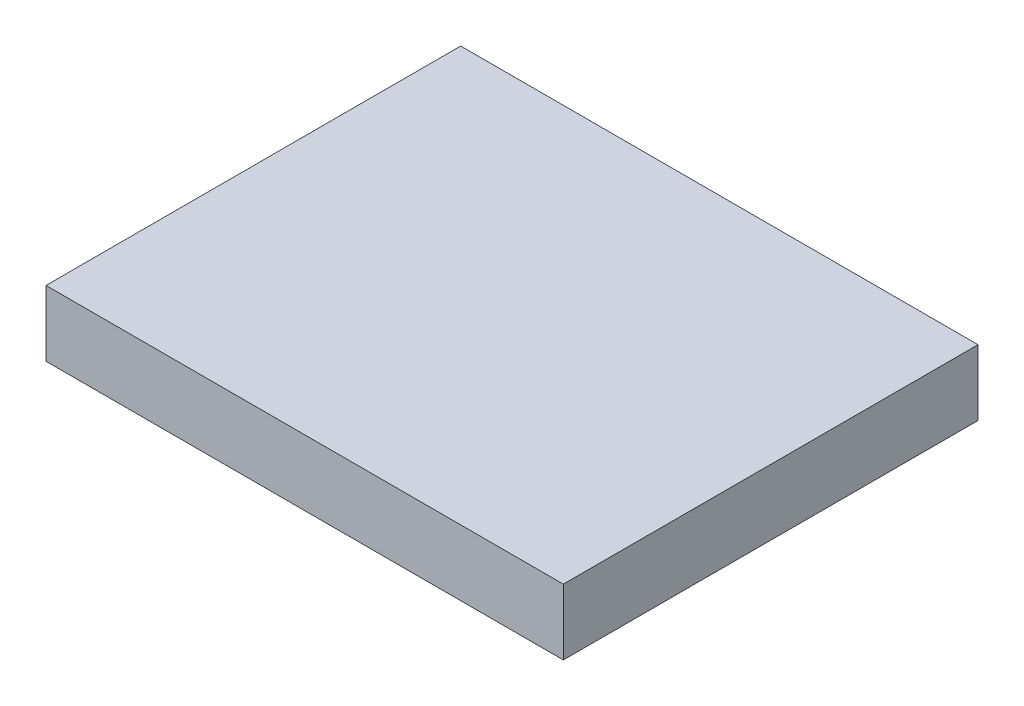
ISO-10303-21;
HEADER;
FILE_DESCRIPTION(('STEP AP214'),'2;1');
FILE_NAME('part.step','',(''),(''),'','','');
FILE_SCHEMA(('AUTOMOTIVE_DESIGN { 1 0 10303 214 1 1 1 1 }'));
ENDSEC;
DATA;
#1=APPLICATION_CONTEXT('core data for automotive mechanical design processes');
#2=APPLICATION_PROTOCOL_DEFINITION('international standard','automotive_design',2000,#1);
#3=PRODUCT_CONTEXT('',#1,'mechanical');
#4=PRODUCT('Part','Part','',(#3));
#5=PRODUCT_RELATED_PRODUCT_CATEGORY('part','',(#4));
#6=PRODUCT_DEFINITION_FORMATION('','',#4);
#7=PRODUCT_DEFINITION_CONTEXT('part definition',#1,'design');
#8=PRODUCT_DEFINITION('design','',#6,#7);
#9=PRODUCT_DEFINITION_SHAPE('','',#8);
#10=(LENGTH_UNIT() NAMED_UNIT(*) SI_UNIT(.MILLI.,.METRE.));
#11=(NAMED_UNIT(*) PLANE_ANGLE_UNIT() SI_UNIT($,.RADIAN.));
#12=(NAMED_UNIT(*) SI_UNIT($,.STERADIAN.) SOLID_ANGLE_UNIT());
#13=UNCERTAINTY_MEASURE_WITH_UNIT(LENGTH_MEASURE(1.E-05),#10,'distance_accuracy_value','');
#14=(GEOMETRIC_REPRESENTATION_CONTEXT(3) GLOBAL_UNCERTAINTY_ASSIGNED_CONTEXT((#13)) GLOBAL_UNIT_ASSIGNED_CONTEXT((#10,
#11,#12)) REPRESENTATION_CONTEXT('',''));
#15=CARTESIAN_POINT('',(0.,0.,0.));
#16=DIRECTION('',(0.,0.,1.));
#17=DIRECTION('',(1.,0.,0.));
#18=AXIS2_PLACEMENT_3D('',#15,#16,#17);
#19=CARTESIAN_POINT('',(31.5,8.,25.25));
#20=DIRECTION('',(-1.,0.,0.));
#21=DIRECTION('',(0.,0.,1.));
#22=AXIS2_PLACEMENT_3D('',#19,#20,#21);
#23=PLANE('',#22);
#24=DIRECTION('',(0.,0.,-1.));
#25=VECTOR('',#24,1.);
#26=CARTESIAN_POINT('',(31.5,0.,25.25));
#27=LINE('',#26,#25);
#28=CARTESIAN_POINT('',(31.5,0.,25.25));
#29=VERTEX_POINT('',#28);
#30=CARTESIAN_POINT('',(31.5,0.,-25.25));
#31=VERTEX_POINT('',#30);
#32=EDGE_CURVE('E100',#29,#31,#27,.T.);
#33=ORIENTED_EDGE('',*,*,#32,.T.);
#34=DIRECTION('',(0.,-1.,0.));
#35=VECTOR('',#34,1.);
#36=CARTESIAN_POINT('',(31.5,8.,-25.25));
#37=LINE('',#36,#35);
#38=CARTESIAN_POINT('',(31.5,8.,-25.25));
#39=VERTEX_POINT('',#38);
#40=EDGE_CURVE('E11',#39,#31,#37,.T.);
#41=ORIENTED_EDGE('',*,*,#40,.F.);
#42=DIRECTION('',(0.,0.,-1.));
#43=VECTOR('',#42,1.);
#44=CARTESIAN_POINT('',(31.5,8.,25.25));
#45=LINE('',#44,#43);
#46=CARTESIAN_POINT('',(31.5,8.,25.25));
#47=VERTEX_POINT('',#46);
#48=EDGE_CURVE('E88',#47,#39,#45,.T.);
#49=ORIENTED_EDGE('',*,*,#48,.F.);
#50=DIRECTION('',(0.,-1.,0.));
#51=VECTOR('',#50,1.);
#52=CARTESIAN_POINT('',(31.5,8.,25.25));
#53=LINE('',#52,#51);
#54=EDGE_CURVE('E96',#47,#29,#53,.T.);
#55=ORIENTED_EDGE('',*,*,#54,.T.);
#56=EDGE_LOOP('',(#33,#41,#49,#55));
#57=FACE_BOUND('',#56,.T.);
#58=ADVANCED_FACE('F37',(#57),#23,.F.);
#59=CARTESIAN_POINT('',(-31.5,8.,-25.25));
#60=DIRECTION('',(0.,0.,1.));
#61=DIRECTION('',(1.,0.,0.));
#62=AXIS2_PLACEMENT_3D('',#59,#60,#61);
#63=PLANE('',#62);
#64=DIRECTION('',(-1.,0.,0.));
#65=VECTOR('',#64,1.);
#66=CARTESIAN_POINT('',(-31.5,0.,-25.25));
#67=LINE('',#66,#65);
#68=CARTESIAN_POINT('',(-31.5,0.,-25.25));
#69=VERTEX_POINT('',#68);
#70=EDGE_CURVE('E92',#31,#69,#67,.T.);
#71=ORIENTED_EDGE('',*,*,#70,.T.);
#72=DIRECTION('',(0.,-1.,0.));
#73=VECTOR('',#72,1.);
#74=CARTESIAN_POINT('',(-31.5,8.,-25.25));
#75=LINE('',#74,#73);
#76=CARTESIAN_POINT('',(-31.5,8.,-25.25));
#77=VERTEX_POINT('',#76);
#78=EDGE_CURVE('E45',#77,#69,#75,.T.);
#79=ORIENTED_EDGE('',*,*,#78,.F.);
#80=DIRECTION('',(-1.,0.,0.));
#81=VECTOR('',#80,1.);
#82=CARTESIAN_POINT('',(-31.5,8.,-25.25));
#83=LINE('',#82,#81);
#84=EDGE_CURVE('E83',#39,#77,#83,.T.);
#85=ORIENTED_EDGE('',*,*,#84,.F.);
#86=ORIENTED_EDGE('',*,*,#40,.T.);
#87=EDGE_LOOP('',(#71,#79,#85,#86));
#88=FACE_BOUND('',#87,.T.);
#89=ADVANCED_FACE('F91',(#88),#63,.F.);
#90=CARTESIAN_POINT('',(-31.5,8.,25.25));
#91=DIRECTION('',(1.,0.,0.));
#92=DIRECTION('',(0.,0.,-1.));
#93=AXIS2_PLACEMENT_3D('',#90,#91,#92);
#94=PLANE('',#93);
#95=DIRECTION('',(0.,0.,1.));
#96=VECTOR('',#95,1.);
#97=CARTESIAN_POINT('',(-31.5,0.,25.25));
#98=LINE('',#97,#96);
#99=CARTESIAN_POINT('',(-31.5,0.,25.25));
#100=VERTEX_POINT('',#99);
#101=EDGE_CURVE('E70',#69,#100,#98,.T.);
#102=ORIENTED_EDGE('',*,*,#101,.T.);
#103=DIRECTION('',(0.,-1.,0.));
#104=VECTOR('',#103,1.);
#105=CARTESIAN_POINT('',(-31.5,8.,25.25));
#106=LINE('',#105,#104);
#107=CARTESIAN_POINT('',(-31.5,8.,25.25));
#108=VERTEX_POINT('',#107);
#109=EDGE_CURVE('E93',#108,#100,#106,.T.);
#110=ORIENTED_EDGE('',*,*,#109,.F.);
#111=DIRECTION('',(0.,0.,1.));
#112=VECTOR('',#111,1.);
#113=CARTESIAN_POINT('',(-31.5,8.,25.25));
#114=LINE('',#113,#112);
#115=EDGE_CURVE('E86',#77,#108,#114,.T.);
#116=ORIENTED_EDGE('',*,*,#115,.F.);
#117=ORIENTED_EDGE('',*,*,#78,.T.);
#118=EDGE_LOOP('',(#102,#110,#116,#117));
#119=FACE_BOUND('',#118,.T.);
#120=ADVANCED_FACE('F94',(#119),#94,.F.);
#121=CARTESIAN_POINT('',(-31.5,8.,25.25));
#122=DIRECTION('',(0.,0.,-1.));
#123=DIRECTION('',(-1.,0.,0.));
#124=AXIS2_PLACEMENT_3D('',#121,#122,#123);
#125=PLANE('',#124);
#126=DIRECTION('',(1.,0.,0.));
#127=VECTOR('',#126,1.);
#128=CARTESIAN_POINT('',(-31.5,0.,25.25));
#129=LINE('',#128,#127);
#130=EDGE_CURVE('E76',#100,#29,#129,.T.);
#131=ORIENTED_EDGE('',*,*,#130,.T.);
#132=ORIENTED_EDGE('',*,*,#54,.F.);
#133=DIRECTION('',(1.,0.,0.));
#134=VECTOR('',#133,1.);
#135=CARTESIAN_POINT('',(-31.5,8.,25.25));
#136=LINE('',#135,#134);
#137=EDGE_CURVE('E53',#108,#47,#136,.T.);
#138=ORIENTED_EDGE('',*,*,#137,.F.);
#139=ORIENTED_EDGE('',*,*,#109,.T.);
#140=EDGE_LOOP('',(#131,#132,#138,#139));
#141=FACE_BOUND('',#140,.T.);
#142=ADVANCED_FACE('F107',(#141),#125,.F.);
#143=CARTESIAN_POINT('',(0.,8.,0.));
#144=DIRECTION('',(0.,-1.,0.));
#145=DIRECTION('',(0.,0.,-1.));
#146=AXIS2_PLACEMENT_3D('',#143,#144,#145);
#147=PLANE('',#146);
#148=ORIENTED_EDGE('',*,*,#48,.T.);
#149=ORIENTED_EDGE('',*,*,#84,.T.);
#150=ORIENTED_EDGE('',*,*,#115,.T.);
#151=ORIENTED_EDGE('',*,*,#137,.T.);
#152=EDGE_LOOP('',(#148,#149,#150,#151));
#153=FACE_BOUND('',#152,.T.);
#154=ADVANCED_FACE('F84',(#153),#147,.F.);
#155=CARTESIAN_POINT('',(0.,0.,0.));
#156=DIRECTION('',(0.,-1.,0.));
#157=DIRECTION('',(0.,0.,-1.));
#158=AXIS2_PLACEMENT_3D('',#155,#156,#157);
#159=PLANE('',#158);
#160=ORIENTED_EDGE('',*,*,#32,.F.);
#161=ORIENTED_EDGE('',*,*,#130,.F.);
#162=ORIENTED_EDGE('',*,*,#101,.F.);
#163=ORIENTED_EDGE('',*,*,#70,.F.);
#164=EDGE_LOOP('',(#160,#161,#162,#163));
#165=FACE_BOUND('',#164,.T.);
#166=ADVANCED_FACE('F110',(#165),#159,.T.);
#167=CLOSED_SHELL('',(#58,#89,#120,#142,#154,#166));
#168=MANIFOLD_SOLID_BREP('B2',#167);
#169=ADVANCED_BREP_SHAPE_REPRESENTATION('',(#18,#168),#14);
#170=SHAPE_DEFINITION_REPRESENTATION(#9,#169);
ENDSEC;
END-ISO-10303-21;
